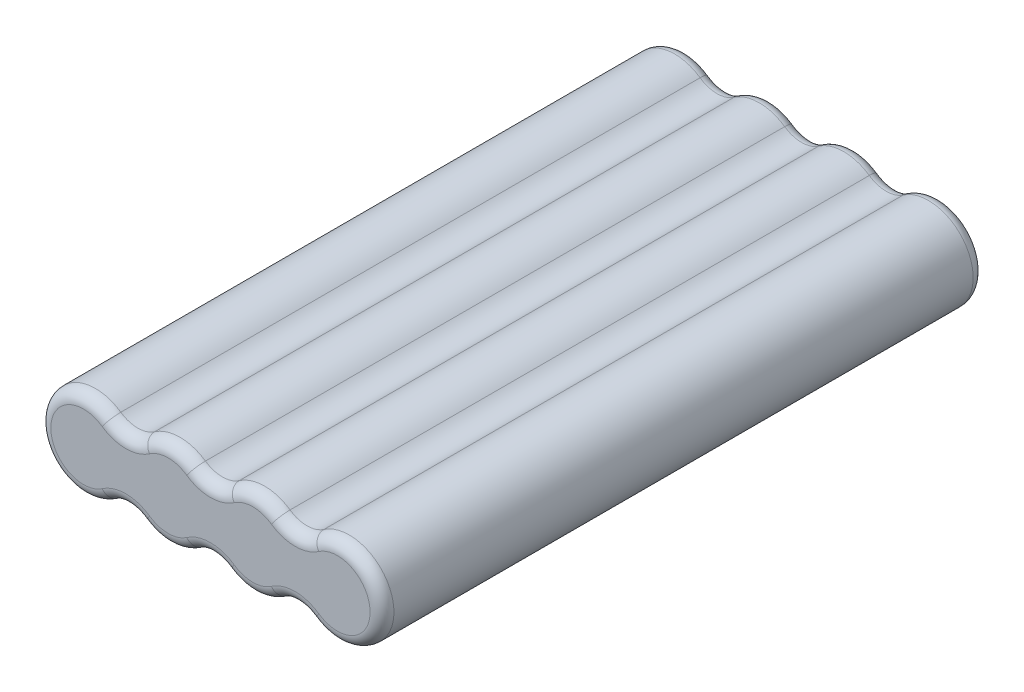
ISO-10303-21;
HEADER;
FILE_DESCRIPTION(('STEP AP214'),'2;1');
FILE_NAME('part.step','',(''),(''),'','','');
FILE_SCHEMA(('AUTOMOTIVE_DESIGN { 1 0 10303 214 1 1 1 1 }'));
ENDSEC;
DATA;
#1=APPLICATION_CONTEXT('core data for automotive mechanical design processes');
#2=APPLICATION_PROTOCOL_DEFINITION('international standard','automotive_design',2000,#1);
#3=PRODUCT_CONTEXT('',#1,'mechanical');
#4=PRODUCT('Part','Part','',(#3));
#5=PRODUCT_RELATED_PRODUCT_CATEGORY('part','',(#4));
#6=PRODUCT_DEFINITION_FORMATION('','',#4);
#7=PRODUCT_DEFINITION_CONTEXT('part definition',#1,'design');
#8=PRODUCT_DEFINITION('design','',#6,#7);
#9=PRODUCT_DEFINITION_SHAPE('','',#8);
#10=(LENGTH_UNIT() NAMED_UNIT(*) SI_UNIT(.MILLI.,.METRE.));
#11=(NAMED_UNIT(*) PLANE_ANGLE_UNIT() SI_UNIT($,.RADIAN.));
#12=(NAMED_UNIT(*) SI_UNIT($,.STERADIAN.) SOLID_ANGLE_UNIT());
#13=UNCERTAINTY_MEASURE_WITH_UNIT(LENGTH_MEASURE(1.E-05),#10,'distance_accuracy_value','');
#14=(GEOMETRIC_REPRESENTATION_CONTEXT(3) GLOBAL_UNCERTAINTY_ASSIGNED_CONTEXT((#13)) GLOBAL_UNIT_ASSIGNED_CONTEXT((#10,
#11,#12)) REPRESENTATION_CONTEXT('',''));
#15=CARTESIAN_POINT('',(0.,0.,0.));
#16=DIRECTION('',(0.,0.,1.));
#17=DIRECTION('',(1.,0.,0.));
#18=AXIS2_PLACEMENT_3D('',#15,#16,#17);
#19=CARTESIAN_POINT('',(14.2193333333333,-10.2811789153233,50.673));
#20=DIRECTION('',(0.,0.,-1.));
#21=DIRECTION('',(-1.,0.,0.));
#22=AXIS2_PLACEMENT_3D('',#19,#20,#21);
#23=CYLINDRICAL_SURFACE('',#22,5.);
#24=DIRECTION('',(0.,0.,-1.));
#25=VECTOR('',#24,1.);
#26=CARTESIAN_POINT('',(11.3754666666667,-6.16870734919399,50.673));
#27=LINE('',#26,#25);
#28=CARTESIAN_POINT('',(11.3754666666667,-6.16870734919399,48.673));
#29=VERTEX_POINT('',#28);
#30=CARTESIAN_POINT('',(11.3754666666667,-6.16870734919399,-48.673));
#31=VERTEX_POINT('',#30);
#32=EDGE_CURVE('E364',#29,#31,#27,.T.);
#33=ORIENTED_EDGE('',*,*,#32,.T.);
#34=CARTESIAN_POINT('',(14.2193333333333,-10.2811789153233,-48.673));
#35=DIRECTION('',(0.,0.,1.));
#36=DIRECTION('',(1.,0.,0.));
#37=AXIS2_PLACEMENT_3D('',#34,#35,#36);
#38=CIRCLE('',#37,5.);
#39=CARTESIAN_POINT('',(17.0632,-6.16870734919399,-48.673));
#40=VERTEX_POINT('',#39);
#41=EDGE_CURVE('E309',#31,#40,#38,.F.);
#42=ORIENTED_EDGE('',*,*,#41,.T.);
#43=DIRECTION('',(0.,0.,-1.));
#44=VECTOR('',#43,1.);
#45=CARTESIAN_POINT('',(17.0632,-6.16870734919399,50.673));
#46=LINE('',#45,#44);
#47=CARTESIAN_POINT('',(17.0632,-6.16870734919399,48.673));
#48=VERTEX_POINT('',#47);
#49=EDGE_CURVE('E224',#48,#40,#46,.T.);
#50=ORIENTED_EDGE('',*,*,#49,.F.);
#51=CARTESIAN_POINT('',(14.2193333333333,-10.2811789153233,48.673));
#52=DIRECTION('',(0.,0.,1.));
#53=DIRECTION('',(1.,0.,0.));
#54=AXIS2_PLACEMENT_3D('',#51,#52,#53);
#55=CIRCLE('',#54,5.);
#56=EDGE_CURVE('E307',#48,#29,#55,.T.);
#57=ORIENTED_EDGE('',*,*,#56,.T.);
#58=EDGE_LOOP('',(#33,#42,#50,#57));
#59=FACE_BOUND('',#58,.T.);
#60=ADVANCED_FACE('F40',(#59),#23,.F.);
#61=CARTESIAN_POINT('',(21.329,0.,50.673));
#62=DIRECTION('',(0.,0.,-1.));
#63=DIRECTION('',(-1.,0.,0.));
#64=AXIS2_PLACEMENT_3D('',#61,#62,#63);
#65=CYLINDRICAL_SURFACE('',#64,7.5);
#66=ORIENTED_EDGE('',*,*,#49,.T.);
#67=CARTESIAN_POINT('',(21.329,0.,-48.673));
#68=DIRECTION('',(0.,0.,1.));
#69=DIRECTION('',(1.,0.,0.));
#70=AXIS2_PLACEMENT_3D('',#67,#68,#69);
#71=CIRCLE('',#70,7.5);
#72=CARTESIAN_POINT('',(17.0632,6.168707349194,-48.673));
#73=VERTEX_POINT('',#72);
#74=EDGE_CURVE('E223',#40,#73,#71,.T.);
#75=ORIENTED_EDGE('',*,*,#74,.T.);
#76=DIRECTION('',(0.,0.,-1.));
#77=VECTOR('',#76,1.);
#78=CARTESIAN_POINT('',(17.0632,6.168707349194,50.673));
#79=LINE('',#78,#77);
#80=CARTESIAN_POINT('',(17.0632,6.168707349194,48.673));
#81=VERTEX_POINT('',#80);
#82=EDGE_CURVE('E205',#81,#73,#79,.T.);
#83=ORIENTED_EDGE('',*,*,#82,.F.);
#84=CARTESIAN_POINT('',(21.329,0.,48.673));
#85=DIRECTION('',(0.,0.,1.));
#86=DIRECTION('',(1.,0.,0.));
#87=AXIS2_PLACEMENT_3D('',#84,#85,#86);
#88=CIRCLE('',#87,7.5);
#89=EDGE_CURVE('E220',#81,#48,#88,.F.);
#90=ORIENTED_EDGE('',*,*,#89,.T.);
#91=EDGE_LOOP('',(#66,#75,#83,#90));
#92=FACE_BOUND('',#91,.T.);
#93=ADVANCED_FACE('F218',(#92),#65,.T.);
#94=CARTESIAN_POINT('',(14.2193333333333,10.2811789153233,50.673));
#95=DIRECTION('',(0.,0.,-1.));
#96=DIRECTION('',(-1.,0.,0.));
#97=AXIS2_PLACEMENT_3D('',#94,#95,#96);
#98=CYLINDRICAL_SURFACE('',#97,5.);
#99=ORIENTED_EDGE('',*,*,#82,.T.);
#100=CARTESIAN_POINT('',(14.2193333333333,10.2811789153233,-48.673));
#101=DIRECTION('',(0.,0.,1.));
#102=DIRECTION('',(1.,0.,0.));
#103=AXIS2_PLACEMENT_3D('',#100,#101,#102);
#104=CIRCLE('',#103,5.);
#105=CARTESIAN_POINT('',(11.3754666666667,6.168707349194,-48.673));
#106=VERTEX_POINT('',#105);
#107=EDGE_CURVE('E212',#73,#106,#104,.F.);
#108=ORIENTED_EDGE('',*,*,#107,.T.);
#109=DIRECTION('',(0.,0.,-1.));
#110=VECTOR('',#109,1.);
#111=CARTESIAN_POINT('',(11.3754666666667,6.168707349194,50.673));
#112=LINE('',#111,#110);
#113=CARTESIAN_POINT('',(11.3754666666667,6.168707349194,48.673));
#114=VERTEX_POINT('',#113);
#115=EDGE_CURVE('E207',#114,#106,#112,.T.);
#116=ORIENTED_EDGE('',*,*,#115,.F.);
#117=CARTESIAN_POINT('',(14.2193333333333,10.2811789153233,48.673));
#118=DIRECTION('',(0.,0.,1.));
#119=DIRECTION('',(1.,0.,0.));
#120=AXIS2_PLACEMENT_3D('',#117,#118,#119);
#121=CIRCLE('',#120,5.);
#122=EDGE_CURVE('E202',#114,#81,#121,.T.);
#123=ORIENTED_EDGE('',*,*,#122,.T.);
#124=EDGE_LOOP('',(#99,#108,#116,#123));
#125=FACE_BOUND('',#124,.T.);
#126=ADVANCED_FACE('F204',(#125),#98,.F.);
#127=CARTESIAN_POINT('',(7.10966666666667,0.,50.673));
#128=DIRECTION('',(0.,0.,-1.));
#129=DIRECTION('',(-1.,0.,0.));
#130=AXIS2_PLACEMENT_3D('',#127,#128,#129);
#131=CYLINDRICAL_SURFACE('',#130,7.5);
#132=ORIENTED_EDGE('',*,*,#115,.T.);
#133=CARTESIAN_POINT('',(7.10966666666667,0.,-48.673));
#134=DIRECTION('',(0.,0.,1.));
#135=DIRECTION('',(1.,0.,0.));
#136=AXIS2_PLACEMENT_3D('',#133,#134,#135);
#137=CIRCLE('',#136,7.5);
#138=CARTESIAN_POINT('',(2.84386666666667,6.168707349194,-48.673));
#139=VERTEX_POINT('',#138);
#140=EDGE_CURVE('E272',#106,#139,#137,.T.);
#141=ORIENTED_EDGE('',*,*,#140,.T.);
#142=DIRECTION('',(0.,0.,-1.));
#143=VECTOR('',#142,1.);
#144=CARTESIAN_POINT('',(2.84386666666667,6.168707349194,50.673));
#145=LINE('',#144,#143);
#146=CARTESIAN_POINT('',(2.84386666666667,6.168707349194,48.673));
#147=VERTEX_POINT('',#146);
#148=EDGE_CURVE('E414',#147,#139,#145,.T.);
#149=ORIENTED_EDGE('',*,*,#148,.F.);
#150=CARTESIAN_POINT('',(7.10966666666667,0.,48.673));
#151=DIRECTION('',(0.,0.,1.));
#152=DIRECTION('',(1.,0.,0.));
#153=AXIS2_PLACEMENT_3D('',#150,#151,#152);
#154=CIRCLE('',#153,7.5);
#155=EDGE_CURVE('E270',#147,#114,#154,.F.);
#156=ORIENTED_EDGE('',*,*,#155,.T.);
#157=EDGE_LOOP('',(#132,#141,#149,#156));
#158=FACE_BOUND('',#157,.T.);
#159=ADVANCED_FACE('F423',(#158),#131,.T.);
#160=CARTESIAN_POINT('',(0.,10.2811789153233,50.673));
#161=DIRECTION('',(0.,0.,-1.));
#162=DIRECTION('',(-1.,0.,0.));
#163=AXIS2_PLACEMENT_3D('',#160,#161,#162);
#164=CYLINDRICAL_SURFACE('',#163,5.);
#165=ORIENTED_EDGE('',*,*,#148,.T.);
#166=CARTESIAN_POINT('',(0.,10.2811789153233,-48.673));
#167=DIRECTION('',(0.,0.,1.));
#168=DIRECTION('',(1.,0.,0.));
#169=AXIS2_PLACEMENT_3D('',#166,#167,#168);
#170=CIRCLE('',#169,5.);
#171=CARTESIAN_POINT('',(-2.84386666666667,6.168707349194,-48.673));
#172=VERTEX_POINT('',#171);
#173=EDGE_CURVE('E276',#139,#172,#170,.F.);
#174=ORIENTED_EDGE('',*,*,#173,.T.);
#175=DIRECTION('',(0.,0.,-1.));
#176=VECTOR('',#175,1.);
#177=CARTESIAN_POINT('',(-2.84386666666667,6.168707349194,50.673));
#178=LINE('',#177,#176);
#179=CARTESIAN_POINT('',(-2.84386666666667,6.168707349194,48.673));
#180=VERTEX_POINT('',#179);
#181=EDGE_CURVE('E405',#180,#172,#178,.T.);
#182=ORIENTED_EDGE('',*,*,#181,.F.);
#183=CARTESIAN_POINT('',(0.,10.2811789153233,48.673));
#184=DIRECTION('',(0.,0.,1.));
#185=DIRECTION('',(1.,0.,0.));
#186=AXIS2_PLACEMENT_3D('',#183,#184,#185);
#187=CIRCLE('',#186,5.);
#188=EDGE_CURVE('E274',#180,#147,#187,.T.);
#189=ORIENTED_EDGE('',*,*,#188,.T.);
#190=EDGE_LOOP('',(#165,#174,#182,#189));
#191=FACE_BOUND('',#190,.T.);
#192=ADVANCED_FACE('F411',(#191),#164,.F.);
#193=CARTESIAN_POINT('',(-7.10966666666667,0.,50.673));
#194=DIRECTION('',(0.,0.,-1.));
#195=DIRECTION('',(-1.,0.,0.));
#196=AXIS2_PLACEMENT_3D('',#193,#194,#195);
#197=CYLINDRICAL_SURFACE('',#196,7.5);
#198=ORIENTED_EDGE('',*,*,#181,.T.);
#199=CARTESIAN_POINT('',(-7.10966666666667,0.,-48.673));
#200=DIRECTION('',(0.,0.,1.));
#201=DIRECTION('',(1.,0.,0.));
#202=AXIS2_PLACEMENT_3D('',#199,#200,#201);
#203=CIRCLE('',#202,7.5);
#204=CARTESIAN_POINT('',(-11.3754666666667,6.168707349194,-48.673));
#205=VERTEX_POINT('',#204);
#206=EDGE_CURVE('E280',#172,#205,#203,.T.);
#207=ORIENTED_EDGE('',*,*,#206,.T.);
#208=DIRECTION('',(0.,0.,-1.));
#209=VECTOR('',#208,1.);
#210=CARTESIAN_POINT('',(-11.3754666666667,6.168707349194,50.673));
#211=LINE('',#210,#209);
#212=CARTESIAN_POINT('',(-11.3754666666667,6.168707349194,48.673));
#213=VERTEX_POINT('',#212);
#214=EDGE_CURVE('E408',#213,#205,#211,.T.);
#215=ORIENTED_EDGE('',*,*,#214,.F.);
#216=CARTESIAN_POINT('',(-7.10966666666667,0.,48.673));
#217=DIRECTION('',(0.,0.,1.));
#218=DIRECTION('',(1.,0.,0.));
#219=AXIS2_PLACEMENT_3D('',#216,#217,#218);
#220=CIRCLE('',#219,7.5);
#221=EDGE_CURVE('E278',#213,#180,#220,.F.);
#222=ORIENTED_EDGE('',*,*,#221,.T.);
#223=EDGE_LOOP('',(#198,#207,#215,#222));
#224=FACE_BOUND('',#223,.T.);
#225=ADVANCED_FACE('F404',(#224),#197,.T.);
#226=CARTESIAN_POINT('',(-14.2193333333333,10.2811789153233,50.673));
#227=DIRECTION('',(0.,0.,-1.));
#228=DIRECTION('',(-1.,0.,0.));
#229=AXIS2_PLACEMENT_3D('',#226,#227,#228);
#230=CYLINDRICAL_SURFACE('',#229,5.);
#231=ORIENTED_EDGE('',*,*,#214,.T.);
#232=CARTESIAN_POINT('',(-14.2193333333333,10.2811789153233,-48.673));
#233=DIRECTION('',(0.,0.,1.));
#234=DIRECTION('',(1.,0.,0.));
#235=AXIS2_PLACEMENT_3D('',#232,#233,#234);
#236=CIRCLE('',#235,5.);
#237=CARTESIAN_POINT('',(-17.0632,6.168707349194,-48.673));
#238=VERTEX_POINT('',#237);
#239=EDGE_CURVE('E284',#205,#238,#236,.F.);
#240=ORIENTED_EDGE('',*,*,#239,.T.);
#241=DIRECTION('',(0.,0.,-1.));
#242=VECTOR('',#241,1.);
#243=CARTESIAN_POINT('',(-17.0632,6.168707349194,50.673));
#244=LINE('',#243,#242);
#245=CARTESIAN_POINT('',(-17.0632,6.168707349194,48.673));
#246=VERTEX_POINT('',#245);
#247=EDGE_CURVE('E417',#246,#238,#244,.T.);
#248=ORIENTED_EDGE('',*,*,#247,.F.);
#249=CARTESIAN_POINT('',(-14.2193333333333,10.2811789153233,48.673));
#250=DIRECTION('',(0.,0.,1.));
#251=DIRECTION('',(1.,0.,0.));
#252=AXIS2_PLACEMENT_3D('',#249,#250,#251);
#253=CIRCLE('',#252,5.);
#254=EDGE_CURVE('E282',#246,#213,#253,.T.);
#255=ORIENTED_EDGE('',*,*,#254,.T.);
#256=EDGE_LOOP('',(#231,#240,#248,#255));
#257=FACE_BOUND('',#256,.T.);
#258=ADVANCED_FACE('F749',(#257),#230,.F.);
#259=CARTESIAN_POINT('',(-21.329,0.,50.673));
#260=DIRECTION('',(0.,0.,-1.));
#261=DIRECTION('',(-1.,0.,0.));
#262=AXIS2_PLACEMENT_3D('',#259,#260,#261);
#263=CYLINDRICAL_SURFACE('',#262,7.5);
#264=ORIENTED_EDGE('',*,*,#247,.T.);
#265=CARTESIAN_POINT('',(-21.329,0.,-48.673));
#266=DIRECTION('',(0.,0.,1.));
#267=DIRECTION('',(1.,0.,0.));
#268=AXIS2_PLACEMENT_3D('',#265,#266,#267);
#269=CIRCLE('',#268,7.5);
#270=CARTESIAN_POINT('',(-17.0632,-6.16870734919399,-48.673));
#271=VERTEX_POINT('',#270);
#272=EDGE_CURVE('E288',#238,#271,#269,.T.);
#273=ORIENTED_EDGE('',*,*,#272,.T.);
#274=DIRECTION('',(0.,0.,-1.));
#275=VECTOR('',#274,1.);
#276=CARTESIAN_POINT('',(-17.0632,-6.16870734919399,50.673));
#277=LINE('',#276,#275);
#278=CARTESIAN_POINT('',(-17.0632,-6.16870734919399,48.673));
#279=VERTEX_POINT('',#278);
#280=EDGE_CURVE('E817',#279,#271,#277,.T.);
#281=ORIENTED_EDGE('',*,*,#280,.F.);
#282=CARTESIAN_POINT('',(-21.329,0.,48.673));
#283=DIRECTION('',(0.,0.,1.));
#284=DIRECTION('',(1.,0.,0.));
#285=AXIS2_PLACEMENT_3D('',#282,#283,#284);
#286=CIRCLE('',#285,7.5);
#287=EDGE_CURVE('E286',#279,#246,#286,.F.);
#288=ORIENTED_EDGE('',*,*,#287,.T.);
#289=EDGE_LOOP('',(#264,#273,#281,#288));
#290=FACE_BOUND('',#289,.T.);
#291=ADVANCED_FACE('F740',(#290),#263,.T.);
#292=CARTESIAN_POINT('',(-14.2193333333333,-10.2811789153233,50.673));
#293=DIRECTION('',(0.,0.,-1.));
#294=DIRECTION('',(-1.,0.,0.));
#295=AXIS2_PLACEMENT_3D('',#292,#293,#294);
#296=CYLINDRICAL_SURFACE('',#295,5.);
#297=ORIENTED_EDGE('',*,*,#280,.T.);
#298=CARTESIAN_POINT('',(-14.2193333333333,-10.2811789153233,-48.673));
#299=DIRECTION('',(0.,0.,1.));
#300=DIRECTION('',(1.,0.,0.));
#301=AXIS2_PLACEMENT_3D('',#298,#299,#300);
#302=CIRCLE('',#301,5.);
#303=CARTESIAN_POINT('',(-11.3754666666667,-6.16870734919399,-48.673));
#304=VERTEX_POINT('',#303);
#305=EDGE_CURVE('E292',#271,#304,#302,.F.);
#306=ORIENTED_EDGE('',*,*,#305,.T.);
#307=DIRECTION('',(0.,0.,-1.));
#308=VECTOR('',#307,1.);
#309=CARTESIAN_POINT('',(-11.3754666666667,-6.16870734919399,50.673));
#310=LINE('',#309,#308);
#311=CARTESIAN_POINT('',(-11.3754666666667,-6.16870734919399,48.673));
#312=VERTEX_POINT('',#311);
#313=EDGE_CURVE('E819',#312,#304,#310,.T.);
#314=ORIENTED_EDGE('',*,*,#313,.F.);
#315=CARTESIAN_POINT('',(-14.2193333333333,-10.2811789153233,48.673));
#316=DIRECTION('',(0.,0.,1.));
#317=DIRECTION('',(1.,0.,0.));
#318=AXIS2_PLACEMENT_3D('',#315,#316,#317);
#319=CIRCLE('',#318,5.);
#320=EDGE_CURVE('E290',#312,#279,#319,.T.);
#321=ORIENTED_EDGE('',*,*,#320,.T.);
#322=EDGE_LOOP('',(#297,#306,#314,#321));
#323=FACE_BOUND('',#322,.T.);
#324=ADVANCED_FACE('F731',(#323),#296,.F.);
#325=CARTESIAN_POINT('',(-7.10966666666667,0.,50.673));
#326=DIRECTION('',(0.,0.,-1.));
#327=DIRECTION('',(-1.,0.,0.));
#328=AXIS2_PLACEMENT_3D('',#325,#326,#327);
#329=CYLINDRICAL_SURFACE('',#328,7.5);
#330=ORIENTED_EDGE('',*,*,#313,.T.);
#331=CARTESIAN_POINT('',(-7.10966666666667,0.,-48.673));
#332=DIRECTION('',(0.,0.,1.));
#333=DIRECTION('',(1.,0.,0.));
#334=AXIS2_PLACEMENT_3D('',#331,#332,#333);
#335=CIRCLE('',#334,7.5);
#336=CARTESIAN_POINT('',(-2.84386666666667,-6.16870734919399,-48.673));
#337=VERTEX_POINT('',#336);
#338=EDGE_CURVE('E296',#304,#337,#335,.T.);
#339=ORIENTED_EDGE('',*,*,#338,.T.);
#340=DIRECTION('',(0.,0.,-1.));
#341=VECTOR('',#340,1.);
#342=CARTESIAN_POINT('',(-2.84386666666667,-6.16870734919399,50.673));
#343=LINE('',#342,#341);
#344=CARTESIAN_POINT('',(-2.84386666666667,-6.16870734919399,48.673));
#345=VERTEX_POINT('',#344);
#346=EDGE_CURVE('E824',#345,#337,#343,.T.);
#347=ORIENTED_EDGE('',*,*,#346,.F.);
#348=CARTESIAN_POINT('',(-7.10966666666667,0.,48.673));
#349=DIRECTION('',(0.,0.,1.));
#350=DIRECTION('',(1.,0.,0.));
#351=AXIS2_PLACEMENT_3D('',#348,#349,#350);
#352=CIRCLE('',#351,7.5);
#353=EDGE_CURVE('E294',#345,#312,#352,.F.);
#354=ORIENTED_EDGE('',*,*,#353,.T.);
#355=EDGE_LOOP('',(#330,#339,#347,#354));
#356=FACE_BOUND('',#355,.T.);
#357=ADVANCED_FACE('F722',(#356),#329,.T.);
#358=CARTESIAN_POINT('',(0.,-10.2811789153233,50.673));
#359=DIRECTION('',(0.,0.,-1.));
#360=DIRECTION('',(-1.,0.,0.));
#361=AXIS2_PLACEMENT_3D('',#358,#359,#360);
#362=CYLINDRICAL_SURFACE('',#361,5.);
#363=ORIENTED_EDGE('',*,*,#346,.T.);
#364=CARTESIAN_POINT('',(0.,-10.2811789153233,-48.673));
#365=DIRECTION('',(0.,0.,1.));
#366=DIRECTION('',(1.,0.,0.));
#367=AXIS2_PLACEMENT_3D('',#364,#365,#366);
#368=CIRCLE('',#367,5.);
#369=CARTESIAN_POINT('',(2.84386666666666,-6.16870734919399,-48.673));
#370=VERTEX_POINT('',#369);
#371=EDGE_CURVE('E300',#337,#370,#368,.F.);
#372=ORIENTED_EDGE('',*,*,#371,.T.);
#373=DIRECTION('',(0.,0.,-1.));
#374=VECTOR('',#373,1.);
#375=CARTESIAN_POINT('',(2.84386666666666,-6.16870734919399,50.673));
#376=LINE('',#375,#374);
#377=CARTESIAN_POINT('',(2.84386666666666,-6.16870734919399,48.673));
#378=VERTEX_POINT('',#377);
#379=EDGE_CURVE('E827',#378,#370,#376,.T.);
#380=ORIENTED_EDGE('',*,*,#379,.F.);
#381=CARTESIAN_POINT('',(0.,-10.2811789153233,48.673));
#382=DIRECTION('',(0.,0.,1.));
#383=DIRECTION('',(1.,0.,0.));
#384=AXIS2_PLACEMENT_3D('',#381,#382,#383);
#385=CIRCLE('',#384,5.);
#386=EDGE_CURVE('E298',#378,#345,#385,.T.);
#387=ORIENTED_EDGE('',*,*,#386,.T.);
#388=EDGE_LOOP('',(#363,#372,#380,#387));
#389=FACE_BOUND('',#388,.T.);
#390=ADVANCED_FACE('F713',(#389),#362,.F.);
#391=CARTESIAN_POINT('',(7.10966666666667,0.,50.673));
#392=DIRECTION('',(0.,0.,-1.));
#393=DIRECTION('',(-1.,0.,0.));
#394=AXIS2_PLACEMENT_3D('',#391,#392,#393);
#395=CYLINDRICAL_SURFACE('',#394,7.5);
#396=ORIENTED_EDGE('',*,*,#379,.T.);
#397=CARTESIAN_POINT('',(7.10966666666667,0.,-48.673));
#398=DIRECTION('',(0.,0.,1.));
#399=DIRECTION('',(1.,0.,0.));
#400=AXIS2_PLACEMENT_3D('',#397,#398,#399);
#401=CIRCLE('',#400,7.5);
#402=EDGE_CURVE('E305',#370,#31,#401,.T.);
#403=ORIENTED_EDGE('',*,*,#402,.T.);
#404=ORIENTED_EDGE('',*,*,#32,.F.);
#405=CARTESIAN_POINT('',(7.10966666666667,0.,48.673));
#406=DIRECTION('',(0.,0.,1.));
#407=DIRECTION('',(1.,0.,0.));
#408=AXIS2_PLACEMENT_3D('',#405,#406,#407);
#409=CIRCLE('',#408,7.5);
#410=EDGE_CURVE('E302',#29,#378,#409,.F.);
#411=ORIENTED_EDGE('',*,*,#410,.T.);
#412=EDGE_LOOP('',(#396,#403,#404,#411));
#413=FACE_BOUND('',#412,.T.);
#414=ADVANCED_FACE('F705',(#413),#395,.T.);
#415=CARTESIAN_POINT('',(10.6645,-5.14058945766166,50.673));
#416=DIRECTION('',(0.,0.,1.));
#417=DIRECTION('',(1.,0.,0.));
#418=AXIS2_PLACEMENT_3D('',#415,#416,#417);
#419=PLANE('',#418);
#420=CARTESIAN_POINT('',(0.,-10.2811789153233,50.673));
#421=DIRECTION('',(0.,0.,1.));
#422=DIRECTION('',(1.,0.,0.));
#423=AXIS2_PLACEMENT_3D('',#420,#421,#422);
#424=CIRCLE('',#423,7.);
#425=CARTESIAN_POINT('',(-3.98141333333334,-4.52371872274226,50.673));
#426=VERTEX_POINT('',#425);
#427=CARTESIAN_POINT('',(3.98141333333333,-4.52371872274226,50.673));
#428=VERTEX_POINT('',#427);
#429=EDGE_CURVE('E49',#426,#428,#424,.F.);
#430=ORIENTED_EDGE('',*,*,#429,.T.);
#431=CARTESIAN_POINT('',(7.10966666666667,0.,50.673));
#432=DIRECTION('',(0.,0.,1.));
#433=DIRECTION('',(1.,0.,0.));
#434=AXIS2_PLACEMENT_3D('',#431,#432,#433);
#435=CIRCLE('',#434,5.5);
#436=CARTESIAN_POINT('',(10.23792,-4.52371872274226,50.673));
#437=VERTEX_POINT('',#436);
#438=EDGE_CURVE('E11',#428,#437,#435,.T.);
#439=ORIENTED_EDGE('',*,*,#438,.T.);
#440=CARTESIAN_POINT('',(14.2193333333333,-10.2811789153233,50.673));
#441=DIRECTION('',(0.,0.,1.));
#442=DIRECTION('',(1.,0.,0.));
#443=AXIS2_PLACEMENT_3D('',#440,#441,#442);
#444=CIRCLE('',#443,7.);
#445=CARTESIAN_POINT('',(18.2007466666667,-4.52371872274226,50.673));
#446=VERTEX_POINT('',#445);
#447=EDGE_CURVE('E311',#437,#446,#444,.F.);
#448=ORIENTED_EDGE('',*,*,#447,.T.);
#449=CARTESIAN_POINT('',(21.329,0.,50.673));
#450=DIRECTION('',(0.,0.,1.));
#451=DIRECTION('',(1.,0.,0.));
#452=AXIS2_PLACEMENT_3D('',#449,#450,#451);
#453=CIRCLE('',#452,5.5);
#454=CARTESIAN_POINT('',(18.2007466666667,4.52371872274226,50.673));
#455=VERTEX_POINT('',#454);
#456=EDGE_CURVE('E313',#446,#455,#453,.T.);
#457=ORIENTED_EDGE('',*,*,#456,.T.);
#458=CARTESIAN_POINT('',(14.2193333333333,10.2811789153233,50.673));
#459=DIRECTION('',(0.,0.,1.));
#460=DIRECTION('',(1.,0.,0.));
#461=AXIS2_PLACEMENT_3D('',#458,#459,#460);
#462=CIRCLE('',#461,7.);
#463=CARTESIAN_POINT('',(10.23792,4.52371872274227,50.673));
#464=VERTEX_POINT('',#463);
#465=EDGE_CURVE('E230',#455,#464,#462,.F.);
#466=ORIENTED_EDGE('',*,*,#465,.T.);
#467=CARTESIAN_POINT('',(7.10966666666667,0.,50.673));
#468=DIRECTION('',(0.,0.,1.));
#469=DIRECTION('',(1.,0.,0.));
#470=AXIS2_PLACEMENT_3D('',#467,#468,#469);
#471=CIRCLE('',#470,5.5);
#472=CARTESIAN_POINT('',(3.98141333333333,4.52371872274227,50.673));
#473=VERTEX_POINT('',#472);
#474=EDGE_CURVE('E316',#464,#473,#471,.T.);
#475=ORIENTED_EDGE('',*,*,#474,.T.);
#476=CARTESIAN_POINT('',(0.,10.2811789153233,50.673));
#477=DIRECTION('',(0.,0.,1.));
#478=DIRECTION('',(1.,0.,0.));
#479=AXIS2_PLACEMENT_3D('',#476,#477,#478);
#480=CIRCLE('',#479,7.);
#481=CARTESIAN_POINT('',(-3.98141333333334,4.52371872274227,50.673));
#482=VERTEX_POINT('',#481);
#483=EDGE_CURVE('E318',#473,#482,#480,.F.);
#484=ORIENTED_EDGE('',*,*,#483,.T.);
#485=CARTESIAN_POINT('',(-7.10966666666667,0.,50.673));
#486=DIRECTION('',(0.,0.,1.));
#487=DIRECTION('',(1.,0.,0.));
#488=AXIS2_PLACEMENT_3D('',#485,#486,#487);
#489=CIRCLE('',#488,5.5);
#490=CARTESIAN_POINT('',(-10.23792,4.52371872274227,50.673));
#491=VERTEX_POINT('',#490);
#492=EDGE_CURVE('E320',#482,#491,#489,.T.);
#493=ORIENTED_EDGE('',*,*,#492,.T.);
#494=CARTESIAN_POINT('',(-14.2193333333333,10.2811789153233,50.673));
#495=DIRECTION('',(0.,0.,1.));
#496=DIRECTION('',(1.,0.,0.));
#497=AXIS2_PLACEMENT_3D('',#494,#495,#496);
#498=CIRCLE('',#497,7.);
#499=CARTESIAN_POINT('',(-18.2007466666667,4.52371872274227,50.673));
#500=VERTEX_POINT('',#499);
#501=EDGE_CURVE('E322',#491,#500,#498,.F.);
#502=ORIENTED_EDGE('',*,*,#501,.T.);
#503=CARTESIAN_POINT('',(-21.329,0.,50.673));
#504=DIRECTION('',(0.,0.,1.));
#505=DIRECTION('',(1.,0.,0.));
#506=AXIS2_PLACEMENT_3D('',#503,#504,#505);
#507=CIRCLE('',#506,5.5);
#508=CARTESIAN_POINT('',(-18.2007466666667,-4.52371872274226,50.673));
#509=VERTEX_POINT('',#508);
#510=EDGE_CURVE('E324',#500,#509,#507,.T.);
#511=ORIENTED_EDGE('',*,*,#510,.T.);
#512=CARTESIAN_POINT('',(-14.2193333333333,-10.2811789153233,50.673));
#513=DIRECTION('',(0.,0.,1.));
#514=DIRECTION('',(1.,0.,0.));
#515=AXIS2_PLACEMENT_3D('',#512,#513,#514);
#516=CIRCLE('',#515,7.);
#517=CARTESIAN_POINT('',(-10.23792,-4.52371872274226,50.673));
#518=VERTEX_POINT('',#517);
#519=EDGE_CURVE('E326',#509,#518,#516,.F.);
#520=ORIENTED_EDGE('',*,*,#519,.T.);
#521=CARTESIAN_POINT('',(-7.10966666666667,0.,50.673));
#522=DIRECTION('',(0.,0.,1.));
#523=DIRECTION('',(1.,0.,0.));
#524=AXIS2_PLACEMENT_3D('',#521,#522,#523);
#525=CIRCLE('',#524,5.5);
#526=EDGE_CURVE('E60',#518,#426,#525,.T.);
#527=ORIENTED_EDGE('',*,*,#526,.T.);
#528=EDGE_LOOP('',(#430,#439,#448,#457,#466,#475,#484,#493,#502,#511,#520,#527));
#529=FACE_BOUND('',#528,.T.);
#530=ADVANCED_FACE('F697',(#529),#419,.T.);
#531=CARTESIAN_POINT('',(10.6645,-5.14058945766166,-50.673));
#532=DIRECTION('',(0.,0.,1.));
#533=DIRECTION('',(1.,0.,0.));
#534=AXIS2_PLACEMENT_3D('',#531,#532,#533);
#535=PLANE('',#534);
#536=CARTESIAN_POINT('',(14.2193333333333,10.2811789153233,-50.673));
#537=DIRECTION('',(0.,0.,1.));
#538=DIRECTION('',(1.,0.,0.));
#539=AXIS2_PLACEMENT_3D('',#536,#537,#538);
#540=CIRCLE('',#539,7.);
#541=CARTESIAN_POINT('',(10.23792,4.52371872274227,-50.673));
#542=VERTEX_POINT('',#541);
#543=CARTESIAN_POINT('',(18.2007466666667,4.52371872274226,-50.673));
#544=VERTEX_POINT('',#543);
#545=EDGE_CURVE('E265',#542,#544,#540,.T.);
#546=ORIENTED_EDGE('',*,*,#545,.T.);
#547=CARTESIAN_POINT('',(21.329,0.,-50.673));
#548=DIRECTION('',(0.,0.,1.));
#549=DIRECTION('',(1.,0.,0.));
#550=AXIS2_PLACEMENT_3D('',#547,#548,#549);
#551=CIRCLE('',#550,5.5);
#552=CARTESIAN_POINT('',(18.2007466666667,-4.52371872274226,-50.673));
#553=VERTEX_POINT('',#552);
#554=EDGE_CURVE('E213',#544,#553,#551,.F.);
#555=ORIENTED_EDGE('',*,*,#554,.T.);
#556=CARTESIAN_POINT('',(14.2193333333333,-10.2811789153233,-50.673));
#557=DIRECTION('',(0.,0.,1.));
#558=DIRECTION('',(1.,0.,0.));
#559=AXIS2_PLACEMENT_3D('',#556,#557,#558);
#560=CIRCLE('',#559,7.);
#561=CARTESIAN_POINT('',(10.23792,-4.52371872274226,-50.673));
#562=VERTEX_POINT('',#561);
#563=EDGE_CURVE('E242',#553,#562,#560,.T.);
#564=ORIENTED_EDGE('',*,*,#563,.T.);
#565=CARTESIAN_POINT('',(7.10966666666667,0.,-50.673));
#566=DIRECTION('',(0.,0.,1.));
#567=DIRECTION('',(1.,0.,0.));
#568=AXIS2_PLACEMENT_3D('',#565,#566,#567);
#569=CIRCLE('',#568,5.5);
#570=CARTESIAN_POINT('',(3.98141333333333,-4.52371872274226,-50.673));
#571=VERTEX_POINT('',#570);
#572=EDGE_CURVE('E247',#562,#571,#569,.F.);
#573=ORIENTED_EDGE('',*,*,#572,.T.);
#574=CARTESIAN_POINT('',(0.,-10.2811789153233,-50.673));
#575=DIRECTION('',(0.,0.,1.));
#576=DIRECTION('',(1.,0.,0.));
#577=AXIS2_PLACEMENT_3D('',#574,#575,#576);
#578=CIRCLE('',#577,7.);
#579=CARTESIAN_POINT('',(-3.98141333333334,-4.52371872274226,-50.673));
#580=VERTEX_POINT('',#579);
#581=EDGE_CURVE('E249',#571,#580,#578,.T.);
#582=ORIENTED_EDGE('',*,*,#581,.T.);
#583=CARTESIAN_POINT('',(-7.10966666666667,0.,-50.673));
#584=DIRECTION('',(0.,0.,1.));
#585=DIRECTION('',(1.,0.,0.));
#586=AXIS2_PLACEMENT_3D('',#583,#584,#585);
#587=CIRCLE('',#586,5.5);
#588=CARTESIAN_POINT('',(-10.23792,-4.52371872274226,-50.673));
#589=VERTEX_POINT('',#588);
#590=EDGE_CURVE('E251',#580,#589,#587,.F.);
#591=ORIENTED_EDGE('',*,*,#590,.T.);
#592=CARTESIAN_POINT('',(-14.2193333333333,-10.2811789153233,-50.673));
#593=DIRECTION('',(0.,0.,1.));
#594=DIRECTION('',(1.,0.,0.));
#595=AXIS2_PLACEMENT_3D('',#592,#593,#594);
#596=CIRCLE('',#595,7.);
#597=CARTESIAN_POINT('',(-18.2007466666667,-4.52371872274226,-50.673));
#598=VERTEX_POINT('',#597);
#599=EDGE_CURVE('E253',#589,#598,#596,.T.);
#600=ORIENTED_EDGE('',*,*,#599,.T.);
#601=CARTESIAN_POINT('',(-21.329,0.,-50.673));
#602=DIRECTION('',(0.,0.,1.));
#603=DIRECTION('',(1.,0.,0.));
#604=AXIS2_PLACEMENT_3D('',#601,#602,#603);
#605=CIRCLE('',#604,5.5);
#606=CARTESIAN_POINT('',(-18.2007466666667,4.52371872274227,-50.673));
#607=VERTEX_POINT('',#606);
#608=EDGE_CURVE('E255',#598,#607,#605,.F.);
#609=ORIENTED_EDGE('',*,*,#608,.T.);
#610=CARTESIAN_POINT('',(-14.2193333333333,10.2811789153233,-50.673));
#611=DIRECTION('',(0.,0.,1.));
#612=DIRECTION('',(1.,0.,0.));
#613=AXIS2_PLACEMENT_3D('',#610,#611,#612);
#614=CIRCLE('',#613,7.);
#615=CARTESIAN_POINT('',(-10.23792,4.52371872274227,-50.673));
#616=VERTEX_POINT('',#615);
#617=EDGE_CURVE('E257',#607,#616,#614,.T.);
#618=ORIENTED_EDGE('',*,*,#617,.T.);
#619=CARTESIAN_POINT('',(-7.10966666666667,0.,-50.673));
#620=DIRECTION('',(0.,0.,1.));
#621=DIRECTION('',(1.,0.,0.));
#622=AXIS2_PLACEMENT_3D('',#619,#620,#621);
#623=CIRCLE('',#622,5.5);
#624=CARTESIAN_POINT('',(-3.98141333333334,4.52371872274227,-50.673));
#625=VERTEX_POINT('',#624);
#626=EDGE_CURVE('E259',#616,#625,#623,.F.);
#627=ORIENTED_EDGE('',*,*,#626,.T.);
#628=CARTESIAN_POINT('',(0.,10.2811789153233,-50.673));
#629=DIRECTION('',(0.,0.,1.));
#630=DIRECTION('',(1.,0.,0.));
#631=AXIS2_PLACEMENT_3D('',#628,#629,#630);
#632=CIRCLE('',#631,7.);
#633=CARTESIAN_POINT('',(3.98141333333333,4.52371872274227,-50.673));
#634=VERTEX_POINT('',#633);
#635=EDGE_CURVE('E261',#625,#634,#632,.T.);
#636=ORIENTED_EDGE('',*,*,#635,.T.);
#637=CARTESIAN_POINT('',(7.10966666666667,0.,-50.673));
#638=DIRECTION('',(0.,0.,1.));
#639=DIRECTION('',(1.,0.,0.));
#640=AXIS2_PLACEMENT_3D('',#637,#638,#639);
#641=CIRCLE('',#640,5.5);
#642=EDGE_CURVE('E263',#634,#542,#641,.F.);
#643=ORIENTED_EDGE('',*,*,#642,.T.);
#644=EDGE_LOOP('',(#546,#555,#564,#573,#582,#591,#600,#609,#618,#627,#636,#643));
#645=FACE_BOUND('',#644,.T.);
#646=ADVANCED_FACE('F437',(#645),#535,.F.);
#647=CARTESIAN_POINT('',(-21.329,0.,-48.673));
#648=DIRECTION('',(0.,0.,1.));
#649=DIRECTION('',(1.,0.,0.));
#650=AXIS2_PLACEMENT_3D('',#647,#648,#649);
#651=TOROIDAL_SURFACE('',#650,5.5,2.);
#652=CARTESIAN_POINT('',(-18.2007466666667,4.52371872274227,-48.673));
#653=DIRECTION('',(0.822494313225866,-0.568773333333333,0.));
#654=DIRECTION('',(0.568773333333333,0.822494313225866,0.));
#655=AXIS2_PLACEMENT_3D('',#652,#653,#654);
#656=CIRCLE('',#655,2.);
#657=EDGE_CURVE('E358',#607,#238,#656,.T.);
#658=ORIENTED_EDGE('',*,*,#657,.F.);
#659=ORIENTED_EDGE('',*,*,#608,.F.);
#660=CARTESIAN_POINT('',(-18.2007466666667,-4.52371872274226,-48.673));
#661=DIRECTION('',(0.822494313225866,0.568773333333333,0.));
#662=DIRECTION('',(-0.568773333333333,0.822494313225866,0.));
#663=AXIS2_PLACEMENT_3D('',#660,#661,#662);
#664=CIRCLE('',#663,2.);
#665=EDGE_CURVE('E361',#271,#598,#664,.T.);
#666=ORIENTED_EDGE('',*,*,#665,.F.);
#667=ORIENTED_EDGE('',*,*,#272,.F.);
#668=EDGE_LOOP('',(#658,#659,#666,#667));
#669=FACE_BOUND('',#668,.T.);
#670=ADVANCED_FACE('F469',(#669),#651,.T.);
#671=CARTESIAN_POINT('',(-14.2193333333333,-10.2811789153233,-48.673));
#672=DIRECTION('',(0.,0.,1.));
#673=DIRECTION('',(1.,0.,0.));
#674=AXIS2_PLACEMENT_3D('',#671,#672,#673);
#675=TOROIDAL_SURFACE('',#674,7.,2.);
#676=ORIENTED_EDGE('',*,*,#665,.T.);
#677=ORIENTED_EDGE('',*,*,#599,.F.);
#678=CARTESIAN_POINT('',(-10.23792,-4.52371872274226,-48.673));
#679=DIRECTION('',(0.822494313225866,-0.568773333333333,0.));
#680=DIRECTION('',(0.568773333333333,0.822494313225866,0.));
#681=AXIS2_PLACEMENT_3D('',#678,#679,#680);
#682=CIRCLE('',#681,2.);
#683=EDGE_CURVE('E355',#304,#589,#682,.T.);
#684=ORIENTED_EDGE('',*,*,#683,.F.);
#685=ORIENTED_EDGE('',*,*,#305,.F.);
#686=EDGE_LOOP('',(#676,#677,#684,#685));
#687=FACE_BOUND('',#686,.T.);
#688=ADVANCED_FACE('F464',(#687),#675,.T.);
#689=CARTESIAN_POINT('',(-14.2193333333333,10.2811789153233,-48.673));
#690=DIRECTION('',(0.,0.,1.));
#691=DIRECTION('',(1.,0.,0.));
#692=AXIS2_PLACEMENT_3D('',#689,#690,#691);
#693=TOROIDAL_SURFACE('',#692,7.,2.);
#694=ORIENTED_EDGE('',*,*,#657,.T.);
#695=ORIENTED_EDGE('',*,*,#239,.F.);
#696=CARTESIAN_POINT('',(-10.23792,4.52371872274227,-48.673));
#697=DIRECTION('',(0.822494313225866,0.568773333333333,0.));
#698=DIRECTION('',(-0.568773333333333,0.822494313225866,0.));
#699=AXIS2_PLACEMENT_3D('',#696,#697,#698);
#700=CIRCLE('',#699,2.);
#701=EDGE_CURVE('E352',#616,#205,#700,.T.);
#702=ORIENTED_EDGE('',*,*,#701,.F.);
#703=ORIENTED_EDGE('',*,*,#617,.F.);
#704=EDGE_LOOP('',(#694,#695,#702,#703));
#705=FACE_BOUND('',#704,.T.);
#706=ADVANCED_FACE('F475',(#705),#693,.T.);
#707=CARTESIAN_POINT('',(-7.10966666666667,0.,-48.673));
#708=DIRECTION('',(0.,0.,1.));
#709=DIRECTION('',(1.,0.,0.));
#710=AXIS2_PLACEMENT_3D('',#707,#708,#709);
#711=TOROIDAL_SURFACE('',#710,5.5,2.);
#712=ORIENTED_EDGE('',*,*,#683,.T.);
#713=ORIENTED_EDGE('',*,*,#590,.F.);
#714=CARTESIAN_POINT('',(-3.98141333333334,-4.52371872274226,-48.673));
#715=DIRECTION('',(0.822494313225866,0.568773333333333,0.));
#716=DIRECTION('',(-0.568773333333333,0.822494313225866,0.));
#717=AXIS2_PLACEMENT_3D('',#714,#715,#716);
#718=CIRCLE('',#717,2.);
#719=EDGE_CURVE('E349',#337,#580,#718,.T.);
#720=ORIENTED_EDGE('',*,*,#719,.F.);
#721=ORIENTED_EDGE('',*,*,#338,.F.);
#722=EDGE_LOOP('',(#712,#713,#720,#721));
#723=FACE_BOUND('',#722,.T.);
#724=ADVANCED_FACE('F459',(#723),#711,.T.);
#725=CARTESIAN_POINT('',(-7.10966666666667,0.,-48.673));
#726=DIRECTION('',(0.,0.,1.));
#727=DIRECTION('',(1.,0.,0.));
#728=AXIS2_PLACEMENT_3D('',#725,#726,#727);
#729=TOROIDAL_SURFACE('',#728,5.5,2.);
#730=ORIENTED_EDGE('',*,*,#701,.T.);
#731=ORIENTED_EDGE('',*,*,#206,.F.);
#732=CARTESIAN_POINT('',(-3.98141333333334,4.52371872274227,-48.673));
#733=DIRECTION('',(0.822494313225866,-0.568773333333334,0.));
#734=DIRECTION('',(0.568773333333334,0.822494313225866,0.));
#735=AXIS2_PLACEMENT_3D('',#732,#733,#734);
#736=CIRCLE('',#735,2.);
#737=EDGE_CURVE('E346',#625,#172,#736,.T.);
#738=ORIENTED_EDGE('',*,*,#737,.F.);
#739=ORIENTED_EDGE('',*,*,#626,.F.);
#740=EDGE_LOOP('',(#730,#731,#738,#739));
#741=FACE_BOUND('',#740,.T.);
#742=ADVANCED_FACE('F480',(#741),#729,.T.);
#743=CARTESIAN_POINT('',(0.,-10.2811789153233,-48.673));
#744=DIRECTION('',(0.,0.,1.));
#745=DIRECTION('',(1.,0.,0.));
#746=AXIS2_PLACEMENT_3D('',#743,#744,#745);
#747=TOROIDAL_SURFACE('',#746,7.,2.);
#748=ORIENTED_EDGE('',*,*,#719,.T.);
#749=ORIENTED_EDGE('',*,*,#581,.F.);
#750=CARTESIAN_POINT('',(3.98141333333333,-4.52371872274226,-48.673));
#751=DIRECTION('',(0.822494313225866,-0.568773333333334,0.));
#752=DIRECTION('',(0.568773333333334,0.822494313225866,0.));
#753=AXIS2_PLACEMENT_3D('',#750,#751,#752);
#754=CIRCLE('',#753,2.);
#755=EDGE_CURVE('E343',#370,#571,#754,.T.);
#756=ORIENTED_EDGE('',*,*,#755,.F.);
#757=ORIENTED_EDGE('',*,*,#371,.F.);
#758=EDGE_LOOP('',(#748,#749,#756,#757));
#759=FACE_BOUND('',#758,.T.);
#760=ADVANCED_FACE('F454',(#759),#747,.T.);
#761=CARTESIAN_POINT('',(0.,10.2811789153233,-48.673));
#762=DIRECTION('',(0.,0.,1.));
#763=DIRECTION('',(1.,0.,0.));
#764=AXIS2_PLACEMENT_3D('',#761,#762,#763);
#765=TOROIDAL_SURFACE('',#764,7.,2.);
#766=ORIENTED_EDGE('',*,*,#737,.T.);
#767=ORIENTED_EDGE('',*,*,#173,.F.);
#768=CARTESIAN_POINT('',(3.98141333333333,4.52371872274227,-48.673));
#769=DIRECTION('',(0.822494313225866,0.568773333333333,0.));
#770=DIRECTION('',(-0.568773333333333,0.822494313225866,0.));
#771=AXIS2_PLACEMENT_3D('',#768,#769,#770);
#772=CIRCLE('',#771,2.);
#773=EDGE_CURVE('E340',#634,#139,#772,.T.);
#774=ORIENTED_EDGE('',*,*,#773,.F.);
#775=ORIENTED_EDGE('',*,*,#635,.F.);
#776=EDGE_LOOP('',(#766,#767,#774,#775));
#777=FACE_BOUND('',#776,.T.);
#778=ADVANCED_FACE('F482',(#777),#765,.T.);
#779=CARTESIAN_POINT('',(7.10966666666667,0.,-48.673));
#780=DIRECTION('',(0.,0.,1.));
#781=DIRECTION('',(1.,0.,0.));
#782=AXIS2_PLACEMENT_3D('',#779,#780,#781);
#783=TOROIDAL_SURFACE('',#782,5.5,2.);
#784=ORIENTED_EDGE('',*,*,#755,.T.);
#785=ORIENTED_EDGE('',*,*,#572,.F.);
#786=CARTESIAN_POINT('',(10.23792,-4.52371872274226,-48.673));
#787=DIRECTION('',(0.822494313225866,0.568773333333333,0.));
#788=DIRECTION('',(-0.568773333333333,0.822494313225866,0.));
#789=AXIS2_PLACEMENT_3D('',#786,#787,#788);
#790=CIRCLE('',#789,2.);
#791=EDGE_CURVE('E337',#31,#562,#790,.T.);
#792=ORIENTED_EDGE('',*,*,#791,.F.);
#793=ORIENTED_EDGE('',*,*,#402,.F.);
#794=EDGE_LOOP('',(#784,#785,#792,#793));
#795=FACE_BOUND('',#794,.T.);
#796=ADVANCED_FACE('F449',(#795),#783,.T.);
#797=CARTESIAN_POINT('',(7.10966666666667,0.,-48.673));
#798=DIRECTION('',(0.,0.,1.));
#799=DIRECTION('',(1.,0.,0.));
#800=AXIS2_PLACEMENT_3D('',#797,#798,#799);
#801=TOROIDAL_SURFACE('',#800,5.5,2.);
#802=ORIENTED_EDGE('',*,*,#773,.T.);
#803=ORIENTED_EDGE('',*,*,#140,.F.);
#804=CARTESIAN_POINT('',(10.23792,4.52371872274227,-48.673));
#805=DIRECTION('',(0.822494313225865,-0.568773333333334,0.));
#806=DIRECTION('',(0.568773333333334,0.822494313225866,0.));
#807=AXIS2_PLACEMENT_3D('',#804,#805,#806);
#808=CIRCLE('',#807,2.);
#809=EDGE_CURVE('E334',#542,#106,#808,.T.);
#810=ORIENTED_EDGE('',*,*,#809,.F.);
#811=ORIENTED_EDGE('',*,*,#642,.F.);
#812=EDGE_LOOP('',(#802,#803,#810,#811));
#813=FACE_BOUND('',#812,.T.);
#814=ADVANCED_FACE('F427',(#813),#801,.T.);
#815=CARTESIAN_POINT('',(14.2193333333333,-10.2811789153233,-48.673));
#816=DIRECTION('',(0.,0.,1.));
#817=DIRECTION('',(1.,0.,0.));
#818=AXIS2_PLACEMENT_3D('',#815,#816,#817);
#819=TOROIDAL_SURFACE('',#818,7.,2.);
#820=ORIENTED_EDGE('',*,*,#791,.T.);
#821=ORIENTED_EDGE('',*,*,#563,.F.);
#822=CARTESIAN_POINT('',(18.2007466666667,-4.52371872274226,-48.673));
#823=DIRECTION('',(0.822494313225866,-0.568773333333333,0.));
#824=DIRECTION('',(0.568773333333333,0.822494313225866,0.));
#825=AXIS2_PLACEMENT_3D('',#822,#823,#824);
#826=CIRCLE('',#825,2.);
#827=EDGE_CURVE('E332',#40,#553,#826,.T.);
#828=ORIENTED_EDGE('',*,*,#827,.F.);
#829=ORIENTED_EDGE('',*,*,#41,.F.);
#830=EDGE_LOOP('',(#820,#821,#828,#829));
#831=FACE_BOUND('',#830,.T.);
#832=ADVANCED_FACE('F444',(#831),#819,.T.);
#833=CARTESIAN_POINT('',(14.2193333333333,10.2811789153233,-48.673));
#834=DIRECTION('',(0.,0.,1.));
#835=DIRECTION('',(1.,0.,0.));
#836=AXIS2_PLACEMENT_3D('',#833,#834,#835);
#837=TOROIDAL_SURFACE('',#836,7.,2.);
#838=ORIENTED_EDGE('',*,*,#809,.T.);
#839=ORIENTED_EDGE('',*,*,#107,.F.);
#840=CARTESIAN_POINT('',(18.2007466666667,4.52371872274226,-48.673));
#841=DIRECTION('',(0.822494313225866,0.568773333333333,0.));
#842=DIRECTION('',(-0.568773333333333,0.822494313225866,0.));
#843=AXIS2_PLACEMENT_3D('',#840,#841,#842);
#844=CIRCLE('',#843,2.);
#845=EDGE_CURVE('E330',#544,#73,#844,.T.);
#846=ORIENTED_EDGE('',*,*,#845,.F.);
#847=ORIENTED_EDGE('',*,*,#545,.F.);
#848=EDGE_LOOP('',(#838,#839,#846,#847));
#849=FACE_BOUND('',#848,.T.);
#850=ADVANCED_FACE('F433',(#849),#837,.T.);
#851=CARTESIAN_POINT('',(21.329,0.,-48.673));
#852=DIRECTION('',(0.,0.,1.));
#853=DIRECTION('',(1.,0.,0.));
#854=AXIS2_PLACEMENT_3D('',#851,#852,#853);
#855=TOROIDAL_SURFACE('',#854,5.5,2.);
#856=ORIENTED_EDGE('',*,*,#827,.T.);
#857=ORIENTED_EDGE('',*,*,#554,.F.);
#858=ORIENTED_EDGE('',*,*,#845,.T.);
#859=ORIENTED_EDGE('',*,*,#74,.F.);
#860=EDGE_LOOP('',(#856,#857,#858,#859));
#861=FACE_BOUND('',#860,.T.);
#862=ADVANCED_FACE('F439',(#861),#855,.T.);
#863=CARTESIAN_POINT('',(-7.10966666666667,0.,48.673));
#864=DIRECTION('',(0.,0.,1.));
#865=DIRECTION('',(1.,0.,0.));
#866=AXIS2_PLACEMENT_3D('',#863,#864,#865);
#867=TOROIDAL_SURFACE('',#866,5.5,2.);
#868=CARTESIAN_POINT('',(-3.98141333333334,4.52371872274227,48.673));
#869=DIRECTION('',(0.822494313225866,-0.568773333333333,0.));
#870=DIRECTION('',(0.568773333333333,0.822494313225866,0.));
#871=AXIS2_PLACEMENT_3D('',#868,#869,#870);
#872=CIRCLE('',#871,2.);
#873=EDGE_CURVE('E384',#180,#482,#872,.T.);
#874=ORIENTED_EDGE('',*,*,#873,.F.);
#875=ORIENTED_EDGE('',*,*,#221,.F.);
#876=CARTESIAN_POINT('',(-10.23792,4.52371872274227,48.673));
#877=DIRECTION('',(-0.822494313225866,-0.568773333333333,0.));
#878=DIRECTION('',(0.568773333333333,-0.822494313225866,0.));
#879=AXIS2_PLACEMENT_3D('',#876,#877,#878);
#880=CIRCLE('',#879,2.);
#881=EDGE_CURVE('E44',#491,#213,#880,.T.);
#882=ORIENTED_EDGE('',*,*,#881,.F.);
#883=ORIENTED_EDGE('',*,*,#492,.F.);
#884=EDGE_LOOP('',(#874,#875,#882,#883));
#885=FACE_BOUND('',#884,.T.);
#886=ADVANCED_FACE('F42',(#885),#867,.T.);
#887=CARTESIAN_POINT('',(-14.2193333333333,10.2811789153233,48.673));
#888=DIRECTION('',(0.,0.,1.));
#889=DIRECTION('',(1.,0.,0.));
#890=AXIS2_PLACEMENT_3D('',#887,#888,#889);
#891=TOROIDAL_SURFACE('',#890,7.,2.);
#892=ORIENTED_EDGE('',*,*,#881,.T.);
#893=ORIENTED_EDGE('',*,*,#254,.F.);
#894=CARTESIAN_POINT('',(-18.2007466666667,4.52371872274227,48.673));
#895=DIRECTION('',(-0.822494313225866,0.568773333333333,0.));
#896=DIRECTION('',(-0.568773333333333,-0.822494313225866,0.));
#897=AXIS2_PLACEMENT_3D('',#894,#895,#896);
#898=CIRCLE('',#897,2.);
#899=EDGE_CURVE('E382',#500,#246,#898,.T.);
#900=ORIENTED_EDGE('',*,*,#899,.F.);
#901=ORIENTED_EDGE('',*,*,#501,.F.);
#902=EDGE_LOOP('',(#892,#893,#900,#901));
#903=FACE_BOUND('',#902,.T.);
#904=ADVANCED_FACE('F395',(#903),#891,.T.);
#905=CARTESIAN_POINT('',(0.,10.2811789153233,48.673));
#906=DIRECTION('',(0.,0.,1.));
#907=DIRECTION('',(1.,0.,0.));
#908=AXIS2_PLACEMENT_3D('',#905,#906,#907);
#909=TOROIDAL_SURFACE('',#908,7.,2.);
#910=ORIENTED_EDGE('',*,*,#873,.T.);
#911=ORIENTED_EDGE('',*,*,#483,.F.);
#912=CARTESIAN_POINT('',(3.98141333333333,4.52371872274227,48.673));
#913=DIRECTION('',(0.822494313225865,0.568773333333334,0.));
#914=DIRECTION('',(-0.568773333333334,0.822494313225866,0.));
#915=AXIS2_PLACEMENT_3D('',#912,#913,#914);
#916=CIRCLE('',#915,2.);
#917=EDGE_CURVE('E379',#147,#473,#916,.T.);
#918=ORIENTED_EDGE('',*,*,#917,.F.);
#919=ORIENTED_EDGE('',*,*,#188,.F.);
#920=EDGE_LOOP('',(#910,#911,#918,#919));
#921=FACE_BOUND('',#920,.T.);
#922=ADVANCED_FACE('F535',(#921),#909,.T.);
#923=CARTESIAN_POINT('',(-21.329,0.,48.673));
#924=DIRECTION('',(0.,0.,1.));
#925=DIRECTION('',(1.,0.,0.));
#926=AXIS2_PLACEMENT_3D('',#923,#924,#925);
#927=TOROIDAL_SURFACE('',#926,5.5,2.);
#928=ORIENTED_EDGE('',*,*,#899,.T.);
#929=ORIENTED_EDGE('',*,*,#287,.F.);
#930=CARTESIAN_POINT('',(-18.2007466666667,-4.52371872274226,48.673));
#931=DIRECTION('',(0.822494313225866,0.568773333333333,0.));
#932=DIRECTION('',(-0.568773333333333,0.822494313225866,0.));
#933=AXIS2_PLACEMENT_3D('',#930,#931,#932);
#934=CIRCLE('',#933,2.);
#935=EDGE_CURVE('E376',#509,#279,#934,.T.);
#936=ORIENTED_EDGE('',*,*,#935,.F.);
#937=ORIENTED_EDGE('',*,*,#510,.F.);
#938=EDGE_LOOP('',(#928,#929,#936,#937));
#939=FACE_BOUND('',#938,.T.);
#940=ADVANCED_FACE('F541',(#939),#927,.T.);
#941=CARTESIAN_POINT('',(7.10966666666667,0.,48.673));
#942=DIRECTION('',(0.,0.,1.));
#943=DIRECTION('',(1.,0.,0.));
#944=AXIS2_PLACEMENT_3D('',#941,#942,#943);
#945=TOROIDAL_SURFACE('',#944,5.5,2.);
#946=ORIENTED_EDGE('',*,*,#917,.T.);
#947=ORIENTED_EDGE('',*,*,#474,.F.);
#948=CARTESIAN_POINT('',(10.23792,4.52371872274227,48.673));
#949=DIRECTION('',(0.822494313225866,-0.568773333333333,0.));
#950=DIRECTION('',(0.568773333333333,0.822494313225866,0.));
#951=AXIS2_PLACEMENT_3D('',#948,#949,#950);
#952=CIRCLE('',#951,2.);
#953=EDGE_CURVE('E374',#114,#464,#952,.T.);
#954=ORIENTED_EDGE('',*,*,#953,.F.);
#955=ORIENTED_EDGE('',*,*,#155,.F.);
#956=EDGE_LOOP('',(#946,#947,#954,#955));
#957=FACE_BOUND('',#956,.T.);
#958=ADVANCED_FACE('F548',(#957),#945,.T.);
#959=CARTESIAN_POINT('',(-14.2193333333333,-10.2811789153233,48.673));
#960=DIRECTION('',(0.,0.,1.));
#961=DIRECTION('',(1.,0.,0.));
#962=AXIS2_PLACEMENT_3D('',#959,#960,#961);
#963=TOROIDAL_SURFACE('',#962,7.,2.);
#964=ORIENTED_EDGE('',*,*,#935,.T.);
#965=ORIENTED_EDGE('',*,*,#320,.F.);
#966=CARTESIAN_POINT('',(-10.23792,-4.52371872274226,48.673));
#967=DIRECTION('',(0.822494313225866,-0.568773333333333,0.));
#968=DIRECTION('',(0.568773333333333,0.822494313225866,0.));
#969=AXIS2_PLACEMENT_3D('',#966,#967,#968);
#970=CIRCLE('',#969,2.);
#971=EDGE_CURVE('E233',#518,#312,#970,.T.);
#972=ORIENTED_EDGE('',*,*,#971,.F.);
#973=ORIENTED_EDGE('',*,*,#519,.F.);
#974=EDGE_LOOP('',(#964,#965,#972,#973));
#975=FACE_BOUND('',#974,.T.);
#976=ADVANCED_FACE('F556',(#975),#963,.T.);
#977=CARTESIAN_POINT('',(14.2193333333333,10.2811789153233,48.673));
#978=DIRECTION('',(0.,0.,1.));
#979=DIRECTION('',(1.,0.,0.));
#980=AXIS2_PLACEMENT_3D('',#977,#978,#979);
#981=TOROIDAL_SURFACE('',#980,7.,2.);
#982=ORIENTED_EDGE('',*,*,#953,.T.);
#983=ORIENTED_EDGE('',*,*,#465,.F.);
#984=CARTESIAN_POINT('',(18.2007466666667,4.52371872274226,48.673));
#985=DIRECTION('',(0.822494313225866,0.568773333333333,0.));
#986=DIRECTION('',(-0.568773333333333,0.822494313225866,0.));
#987=AXIS2_PLACEMENT_3D('',#984,#985,#986);
#988=CIRCLE('',#987,2.);
#989=EDGE_CURVE('E228',#81,#455,#988,.T.);
#990=ORIENTED_EDGE('',*,*,#989,.F.);
#991=ORIENTED_EDGE('',*,*,#122,.F.);
#992=EDGE_LOOP('',(#982,#983,#990,#991));
#993=FACE_BOUND('',#992,.T.);
#994=ADVANCED_FACE('F229',(#993),#981,.T.);
#995=CARTESIAN_POINT('',(-7.10966666666667,0.,48.673));
#996=DIRECTION('',(0.,0.,1.));
#997=DIRECTION('',(1.,0.,0.));
#998=AXIS2_PLACEMENT_3D('',#995,#996,#997);
#999=TOROIDAL_SURFACE('',#998,5.5,2.);
#1000=ORIENTED_EDGE('',*,*,#971,.T.);
#1001=ORIENTED_EDGE('',*,*,#353,.F.);
#1002=CARTESIAN_POINT('',(-3.98141333333334,-4.52371872274226,48.673));
#1003=DIRECTION('',(0.822494313225865,0.568773333333334,0.));
#1004=DIRECTION('',(-0.568773333333334,0.822494313225866,0.));
#1005=AXIS2_PLACEMENT_3D('',#1002,#1003,#1004);
#1006=CIRCLE('',#1005,2.);
#1007=EDGE_CURVE('E234',#426,#345,#1006,.T.);
#1008=ORIENTED_EDGE('',*,*,#1007,.F.);
#1009=ORIENTED_EDGE('',*,*,#526,.F.);
#1010=EDGE_LOOP('',(#1000,#1001,#1008,#1009));
#1011=FACE_BOUND('',#1010,.T.);
#1012=ADVANCED_FACE('F571',(#1011),#999,.T.);
#1013=CARTESIAN_POINT('',(21.329,0.,48.673));
#1014=DIRECTION('',(0.,0.,1.));
#1015=DIRECTION('',(1.,0.,0.));
#1016=AXIS2_PLACEMENT_3D('',#1013,#1014,#1015);
#1017=TOROIDAL_SURFACE('',#1016,5.5,2.);
#1018=ORIENTED_EDGE('',*,*,#989,.T.);
#1019=ORIENTED_EDGE('',*,*,#456,.F.);
#1020=CARTESIAN_POINT('',(18.2007466666667,-4.52371872274226,48.673));
#1021=DIRECTION('',(-0.822494313225866,0.568773333333333,0.));
#1022=DIRECTION('',(-0.568773333333333,-0.822494313225866,0.));
#1023=AXIS2_PLACEMENT_3D('',#1020,#1021,#1022);
#1024=CIRCLE('',#1023,2.);
#1025=EDGE_CURVE('E239',#48,#446,#1024,.T.);
#1026=ORIENTED_EDGE('',*,*,#1025,.F.);
#1027=ORIENTED_EDGE('',*,*,#89,.F.);
#1028=EDGE_LOOP('',(#1018,#1019,#1026,#1027));
#1029=FACE_BOUND('',#1028,.T.);
#1030=ADVANCED_FACE('F237',(#1029),#1017,.T.);
#1031=CARTESIAN_POINT('',(0.,-10.2811789153233,48.673));
#1032=DIRECTION('',(0.,0.,1.));
#1033=DIRECTION('',(1.,0.,0.));
#1034=AXIS2_PLACEMENT_3D('',#1031,#1032,#1033);
#1035=TOROIDAL_SURFACE('',#1034,7.,2.);
#1036=ORIENTED_EDGE('',*,*,#1007,.T.);
#1037=ORIENTED_EDGE('',*,*,#386,.F.);
#1038=CARTESIAN_POINT('',(3.98141333333333,-4.52371872274226,48.673));
#1039=DIRECTION('',(0.822494313225866,-0.568773333333334,0.));
#1040=DIRECTION('',(0.568773333333334,0.822494313225866,0.));
#1041=AXIS2_PLACEMENT_3D('',#1038,#1039,#1040);
#1042=CIRCLE('',#1041,2.);
#1043=EDGE_CURVE('E367',#428,#378,#1042,.T.);
#1044=ORIENTED_EDGE('',*,*,#1043,.F.);
#1045=ORIENTED_EDGE('',*,*,#429,.F.);
#1046=EDGE_LOOP('',(#1036,#1037,#1044,#1045));
#1047=FACE_BOUND('',#1046,.T.);
#1048=ADVANCED_FACE('F585',(#1047),#1035,.T.);
#1049=CARTESIAN_POINT('',(14.2193333333333,-10.2811789153233,48.673));
#1050=DIRECTION('',(0.,0.,1.));
#1051=DIRECTION('',(1.,0.,0.));
#1052=AXIS2_PLACEMENT_3D('',#1049,#1050,#1051);
#1053=TOROIDAL_SURFACE('',#1052,7.,2.);
#1054=ORIENTED_EDGE('',*,*,#1025,.T.);
#1055=ORIENTED_EDGE('',*,*,#447,.F.);
#1056=CARTESIAN_POINT('',(10.23792,-4.52371872274226,48.673));
#1057=DIRECTION('',(-0.822494313225865,-0.568773333333334,0.));
#1058=DIRECTION('',(0.568773333333334,-0.822494313225866,0.));
#1059=AXIS2_PLACEMENT_3D('',#1056,#1057,#1058);
#1060=CIRCLE('',#1059,2.);
#1061=EDGE_CURVE('E365',#29,#437,#1060,.T.);
#1062=ORIENTED_EDGE('',*,*,#1061,.F.);
#1063=ORIENTED_EDGE('',*,*,#56,.F.);
#1064=EDGE_LOOP('',(#1054,#1055,#1062,#1063));
#1065=FACE_BOUND('',#1064,.T.);
#1066=ADVANCED_FACE('F592',(#1065),#1053,.T.);
#1067=CARTESIAN_POINT('',(7.10966666666667,0.,48.673));
#1068=DIRECTION('',(0.,0.,1.));
#1069=DIRECTION('',(1.,0.,0.));
#1070=AXIS2_PLACEMENT_3D('',#1067,#1068,#1069);
#1071=TOROIDAL_SURFACE('',#1070,5.5,2.);
#1072=ORIENTED_EDGE('',*,*,#1043,.T.);
#1073=ORIENTED_EDGE('',*,*,#410,.F.);
#1074=ORIENTED_EDGE('',*,*,#1061,.T.);
#1075=ORIENTED_EDGE('',*,*,#438,.F.);
#1076=EDGE_LOOP('',(#1072,#1073,#1074,#1075));
#1077=FACE_BOUND('',#1076,.T.);
#1078=ADVANCED_FACE('F600',(#1077),#1071,.T.);
#1079=CLOSED_SHELL('',(#60,#93,#126,#159,#192,#225,#258,#291,#324,#357,#390,#414,#530,#646,#670,
#688,#706,#724,#742,#760,#778,#796,#814,#832,#850,#862,#886,#904,#922,#940,#958,#976,#994,#1012,
#1030,#1048,#1066,#1078));
#1080=MANIFOLD_SOLID_BREP('B2',#1079);
#1081=ADVANCED_BREP_SHAPE_REPRESENTATION('',(#18,#1080),#14);
#1082=SHAPE_DEFINITION_REPRESENTATION(#9,#1081);
ENDSEC;
END-ISO-10303-21;
